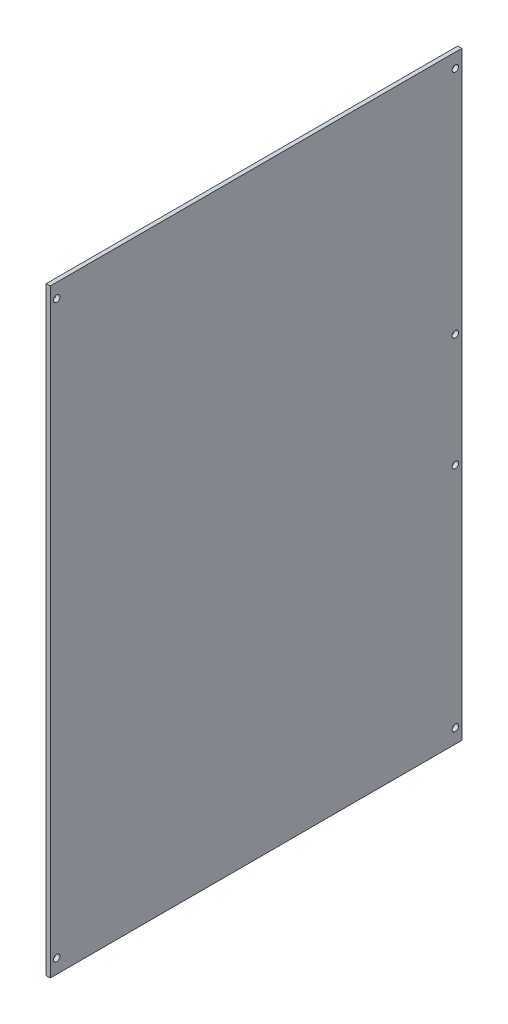
ISO-10303-21;
HEADER;
FILE_DESCRIPTION(('STEP AP214'),'2;1');
FILE_NAME('part.step','',(''),(''),'','','');
FILE_SCHEMA(('AUTOMOTIVE_DESIGN { 1 0 10303 214 1 1 1 1 }'));
ENDSEC;
DATA;
#1=APPLICATION_CONTEXT('core data for automotive mechanical design processes');
#2=APPLICATION_PROTOCOL_DEFINITION('international standard','automotive_design',2000,#1);
#3=PRODUCT_CONTEXT('',#1,'mechanical');
#4=PRODUCT('Part','Part','',(#3));
#5=PRODUCT_RELATED_PRODUCT_CATEGORY('part','',(#4));
#6=PRODUCT_DEFINITION_FORMATION('','',#4);
#7=PRODUCT_DEFINITION_CONTEXT('part definition',#1,'design');
#8=PRODUCT_DEFINITION('design','',#6,#7);
#9=PRODUCT_DEFINITION_SHAPE('','',#8);
#10=(LENGTH_UNIT() NAMED_UNIT(*) SI_UNIT(.MILLI.,.METRE.));
#11=(NAMED_UNIT(*) PLANE_ANGLE_UNIT() SI_UNIT($,.RADIAN.));
#12=(NAMED_UNIT(*) SI_UNIT($,.STERADIAN.) SOLID_ANGLE_UNIT());
#13=UNCERTAINTY_MEASURE_WITH_UNIT(LENGTH_MEASURE(1.E-05),#10,'distance_accuracy_value','');
#14=(GEOMETRIC_REPRESENTATION_CONTEXT(3) GLOBAL_UNCERTAINTY_ASSIGNED_CONTEXT((#13)) GLOBAL_UNIT_ASSIGNED_CONTEXT((#10,
#11,#12)) REPRESENTATION_CONTEXT('',''));
#15=CARTESIAN_POINT('',(0.,0.,0.));
#16=DIRECTION('',(0.,0.,1.));
#17=DIRECTION('',(1.,0.,0.));
#18=AXIS2_PLACEMENT_3D('',#15,#16,#17);
#19=CARTESIAN_POINT('',(1.5875,0.,0.));
#20=DIRECTION('',(-1.,0.,0.));
#21=DIRECTION('',(0.,0.,1.));
#22=AXIS2_PLACEMENT_3D('',#19,#20,#21);
#23=PLANE('',#22);
#24=CARTESIAN_POINT('',(1.5875,5.50000000000001,-2.50000000000233));
#25=DIRECTION('',(1.,0.,0.));
#26=DIRECTION('',(0.,0.,-1.));
#27=AXIS2_PLACEMENT_3D('',#24,#25,#26);
#28=CIRCLE('',#27,1.25);
#29=CARTESIAN_POINT('',(1.5875,5.50000000000001,-3.75000000000233));
#30=VERTEX_POINT('',#29);
#31=EDGE_CURVE('E133',#30,#30,#28,.T.);
#32=ORIENTED_EDGE('',*,*,#31,.F.);
#33=EDGE_LOOP('',(#32));
#34=FACE_BOUND('',#33,.T.);
#35=CARTESIAN_POINT('',(1.5875,227.5,-157.5));
#36=DIRECTION('',(1.,0.,0.));
#37=DIRECTION('',(0.,0.,-1.));
#38=AXIS2_PLACEMENT_3D('',#35,#36,#37);
#39=CIRCLE('',#38,1.25000000000001);
#40=CARTESIAN_POINT('',(1.5875,227.5,-158.75));
#41=VERTEX_POINT('',#40);
#42=EDGE_CURVE('E121',#41,#41,#39,.T.);
#43=ORIENTED_EDGE('',*,*,#42,.F.);
#44=EDGE_LOOP('',(#43));
#45=FACE_BOUND('',#44,.T.);
#46=CARTESIAN_POINT('',(1.5875,227.5,-2.5));
#47=DIRECTION('',(1.,0.,0.));
#48=DIRECTION('',(0.,0.,-1.));
#49=AXIS2_PLACEMENT_3D('',#46,#47,#48);
#50=CIRCLE('',#49,1.25);
#51=CARTESIAN_POINT('',(1.5875,227.5,-3.75));
#52=VERTEX_POINT('',#51);
#53=EDGE_CURVE('E100',#52,#52,#50,.T.);
#54=ORIENTED_EDGE('',*,*,#53,.F.);
#55=EDGE_LOOP('',(#54));
#56=FACE_BOUND('',#55,.T.);
#57=DIRECTION('',(0.,-1.,0.));
#58=VECTOR('',#57,1.);
#59=CARTESIAN_POINT('',(1.5875,0.,0.));
#60=LINE('',#59,#58);
#61=CARTESIAN_POINT('',(1.5875,233.,0.));
#62=VERTEX_POINT('',#61);
#63=CARTESIAN_POINT('',(1.5875,0.,0.));
#64=VERTEX_POINT('',#63);
#65=EDGE_CURVE('E85',#62,#64,#60,.T.);
#66=ORIENTED_EDGE('',*,*,#65,.T.);
#67=DIRECTION('',(0.,0.,-1.));
#68=VECTOR('',#67,1.);
#69=CARTESIAN_POINT('',(1.5875,0.,0.));
#70=LINE('',#69,#68);
#71=CARTESIAN_POINT('',(1.5875,0.,-160.));
#72=VERTEX_POINT('',#71);
#73=EDGE_CURVE('E80',#64,#72,#70,.T.);
#74=ORIENTED_EDGE('',*,*,#73,.T.);
#75=DIRECTION('',(0.,1.,0.));
#76=VECTOR('',#75,1.);
#77=CARTESIAN_POINT('',(1.5875,0.,-160.));
#78=LINE('',#77,#76);
#79=CARTESIAN_POINT('',(1.5875,233.,-160.));
#80=VERTEX_POINT('',#79);
#81=EDGE_CURVE('E83',#72,#80,#78,.T.);
#82=ORIENTED_EDGE('',*,*,#81,.T.);
#83=DIRECTION('',(0.,0.,1.));
#84=VECTOR('',#83,1.);
#85=CARTESIAN_POINT('',(1.5875,233.,0.));
#86=LINE('',#85,#84);
#87=EDGE_CURVE('E50',#80,#62,#86,.T.);
#88=ORIENTED_EDGE('',*,*,#87,.T.);
#89=EDGE_LOOP('',(#66,#74,#82,#88));
#90=FACE_BOUND('',#89,.T.);
#91=CARTESIAN_POINT('',(1.5875,94.,-157.5));
#92=DIRECTION('',(1.,0.,0.));
#93=DIRECTION('',(0.,0.,-1.));
#94=AXIS2_PLACEMENT_3D('',#91,#92,#93);
#95=CIRCLE('',#94,1.25000000000001);
#96=CARTESIAN_POINT('',(1.5875,94.,-158.75));
#97=VERTEX_POINT('',#96);
#98=EDGE_CURVE('E115',#97,#97,#95,.T.);
#99=ORIENTED_EDGE('',*,*,#98,.F.);
#100=EDGE_LOOP('',(#99));
#101=FACE_BOUND('',#100,.T.);
#102=CARTESIAN_POINT('',(1.5875,5.50000000000001,-157.500000000002));
#103=DIRECTION('',(1.,0.,0.));
#104=DIRECTION('',(0.,0.,-1.));
#105=AXIS2_PLACEMENT_3D('',#102,#103,#104);
#106=CIRCLE('',#105,1.25000000000001);
#107=CARTESIAN_POINT('',(1.5875,5.50000000000001,-158.750000000002));
#108=VERTEX_POINT('',#107);
#109=EDGE_CURVE('E127',#108,#108,#106,.T.);
#110=ORIENTED_EDGE('',*,*,#109,.F.);
#111=EDGE_LOOP('',(#110));
#112=FACE_BOUND('',#111,.T.);
#113=CARTESIAN_POINT('',(1.5875,138.,-157.5));
#114=DIRECTION('',(1.,0.,0.));
#115=DIRECTION('',(0.,0.,-1.));
#116=AXIS2_PLACEMENT_3D('',#113,#114,#115);
#117=CIRCLE('',#116,1.25000000000001);
#118=CARTESIAN_POINT('',(1.5875,138.,-158.75));
#119=VERTEX_POINT('',#118);
#120=EDGE_CURVE('E139',#119,#119,#117,.T.);
#121=ORIENTED_EDGE('',*,*,#120,.F.);
#122=EDGE_LOOP('',(#121));
#123=FACE_BOUND('',#122,.T.);
#124=ADVANCED_FACE('F33',(#34,#45,#56,#90,#101,#112,#123),#23,.F.);
#125=CARTESIAN_POINT('',(0.,0.,0.));
#126=DIRECTION('',(-1.,0.,0.));
#127=DIRECTION('',(0.,0.,1.));
#128=AXIS2_PLACEMENT_3D('',#125,#126,#127);
#129=PLANE('',#128);
#130=CARTESIAN_POINT('',(0.,5.50000000000001,-2.50000000000233));
#131=DIRECTION('',(1.,0.,0.));
#132=DIRECTION('',(0.,0.,-1.));
#133=AXIS2_PLACEMENT_3D('',#130,#131,#132);
#134=CIRCLE('',#133,1.25);
#135=CARTESIAN_POINT('',(0.,5.50000000000001,-3.75000000000233));
#136=VERTEX_POINT('',#135);
#137=EDGE_CURVE('E136',#136,#136,#134,.T.);
#138=ORIENTED_EDGE('',*,*,#137,.T.);
#139=EDGE_LOOP('',(#138));
#140=FACE_BOUND('',#139,.T.);
#141=CARTESIAN_POINT('',(0.,227.5,-157.5));
#142=DIRECTION('',(1.,0.,0.));
#143=DIRECTION('',(0.,0.,-1.));
#144=AXIS2_PLACEMENT_3D('',#141,#142,#143);
#145=CIRCLE('',#144,1.25000000000001);
#146=CARTESIAN_POINT('',(0.,227.5,-158.75));
#147=VERTEX_POINT('',#146);
#148=EDGE_CURVE('E124',#147,#147,#145,.T.);
#149=ORIENTED_EDGE('',*,*,#148,.T.);
#150=EDGE_LOOP('',(#149));
#151=FACE_BOUND('',#150,.T.);
#152=CARTESIAN_POINT('',(0.,227.5,-2.5));
#153=DIRECTION('',(1.,0.,0.));
#154=DIRECTION('',(0.,0.,-1.));
#155=AXIS2_PLACEMENT_3D('',#152,#153,#154);
#156=CIRCLE('',#155,1.25);
#157=CARTESIAN_POINT('',(0.,227.5,-3.75));
#158=VERTEX_POINT('',#157);
#159=EDGE_CURVE('E112',#158,#158,#156,.T.);
#160=ORIENTED_EDGE('',*,*,#159,.T.);
#161=EDGE_LOOP('',(#160));
#162=FACE_BOUND('',#161,.T.);
#163=DIRECTION('',(0.,-1.,0.));
#164=VECTOR('',#163,1.);
#165=CARTESIAN_POINT('',(0.,0.,0.));
#166=LINE('',#165,#164);
#167=CARTESIAN_POINT('',(0.,233.,0.));
#168=VERTEX_POINT('',#167);
#169=CARTESIAN_POINT('',(0.,0.,0.));
#170=VERTEX_POINT('',#169);
#171=EDGE_CURVE('E97',#168,#170,#166,.T.);
#172=ORIENTED_EDGE('',*,*,#171,.F.);
#173=DIRECTION('',(0.,0.,1.));
#174=VECTOR('',#173,1.);
#175=CARTESIAN_POINT('',(0.,233.,0.));
#176=LINE('',#175,#174);
#177=CARTESIAN_POINT('',(0.,233.,-160.));
#178=VERTEX_POINT('',#177);
#179=EDGE_CURVE('E73',#178,#168,#176,.T.);
#180=ORIENTED_EDGE('',*,*,#179,.F.);
#181=DIRECTION('',(0.,1.,0.));
#182=VECTOR('',#181,1.);
#183=CARTESIAN_POINT('',(0.,0.,-160.));
#184=LINE('',#183,#182);
#185=CARTESIAN_POINT('',(0.,0.,-160.));
#186=VERTEX_POINT('',#185);
#187=EDGE_CURVE('E67',#186,#178,#184,.T.);
#188=ORIENTED_EDGE('',*,*,#187,.F.);
#189=DIRECTION('',(0.,0.,-1.));
#190=VECTOR('',#189,1.);
#191=CARTESIAN_POINT('',(0.,0.,0.));
#192=LINE('',#191,#190);
#193=EDGE_CURVE('E89',#170,#186,#192,.T.);
#194=ORIENTED_EDGE('',*,*,#193,.F.);
#195=EDGE_LOOP('',(#172,#180,#188,#194));
#196=FACE_BOUND('',#195,.T.);
#197=CARTESIAN_POINT('',(0.,94.,-157.5));
#198=DIRECTION('',(1.,0.,0.));
#199=DIRECTION('',(0.,0.,-1.));
#200=AXIS2_PLACEMENT_3D('',#197,#198,#199);
#201=CIRCLE('',#200,1.25000000000001);
#202=CARTESIAN_POINT('',(0.,94.,-158.75));
#203=VERTEX_POINT('',#202);
#204=EDGE_CURVE('E118',#203,#203,#201,.T.);
#205=ORIENTED_EDGE('',*,*,#204,.T.);
#206=EDGE_LOOP('',(#205));
#207=FACE_BOUND('',#206,.T.);
#208=CARTESIAN_POINT('',(0.,5.50000000000001,-157.500000000002));
#209=DIRECTION('',(1.,0.,0.));
#210=DIRECTION('',(0.,0.,-1.));
#211=AXIS2_PLACEMENT_3D('',#208,#209,#210);
#212=CIRCLE('',#211,1.25000000000001);
#213=CARTESIAN_POINT('',(0.,5.50000000000001,-158.750000000002));
#214=VERTEX_POINT('',#213);
#215=EDGE_CURVE('E130',#214,#214,#212,.T.);
#216=ORIENTED_EDGE('',*,*,#215,.T.);
#217=EDGE_LOOP('',(#216));
#218=FACE_BOUND('',#217,.T.);
#219=CARTESIAN_POINT('',(0.,138.,-157.5));
#220=DIRECTION('',(1.,0.,0.));
#221=DIRECTION('',(0.,0.,-1.));
#222=AXIS2_PLACEMENT_3D('',#219,#220,#221);
#223=CIRCLE('',#222,1.25000000000001);
#224=CARTESIAN_POINT('',(0.,138.,-158.75));
#225=VERTEX_POINT('',#224);
#226=EDGE_CURVE('E142',#225,#225,#223,.T.);
#227=ORIENTED_EDGE('',*,*,#226,.T.);
#228=EDGE_LOOP('',(#227));
#229=FACE_BOUND('',#228,.T.);
#230=ADVANCED_FACE('F108',(#140,#151,#162,#196,#207,#218,#229),#129,.T.);
#231=CARTESIAN_POINT('',(1.5875,0.,0.));
#232=DIRECTION('',(0.,0.,-1.));
#233=DIRECTION('',(-1.,0.,0.));
#234=AXIS2_PLACEMENT_3D('',#231,#232,#233);
#235=PLANE('',#234);
#236=ORIENTED_EDGE('',*,*,#171,.T.);
#237=DIRECTION('',(-1.,0.,0.));
#238=VECTOR('',#237,1.);
#239=CARTESIAN_POINT('',(1.5875,0.,0.));
#240=LINE('',#239,#238);
#241=EDGE_CURVE('E11',#64,#170,#240,.T.);
#242=ORIENTED_EDGE('',*,*,#241,.F.);
#243=ORIENTED_EDGE('',*,*,#65,.F.);
#244=DIRECTION('',(-1.,0.,0.));
#245=VECTOR('',#244,1.);
#246=CARTESIAN_POINT('',(1.5875,233.,0.));
#247=LINE('',#246,#245);
#248=EDGE_CURVE('E93',#62,#168,#247,.T.);
#249=ORIENTED_EDGE('',*,*,#248,.T.);
#250=EDGE_LOOP('',(#236,#242,#243,#249));
#251=FACE_BOUND('',#250,.T.);
#252=ADVANCED_FACE('F35',(#251),#235,.F.);
#253=CARTESIAN_POINT('',(1.5875,0.,0.));
#254=DIRECTION('',(0.,1.,0.));
#255=DIRECTION('',(0.,0.,1.));
#256=AXIS2_PLACEMENT_3D('',#253,#254,#255);
#257=PLANE('',#256);
#258=ORIENTED_EDGE('',*,*,#193,.T.);
#259=DIRECTION('',(-1.,0.,0.));
#260=VECTOR('',#259,1.);
#261=CARTESIAN_POINT('',(1.5875,0.,-160.));
#262=LINE('',#261,#260);
#263=EDGE_CURVE('E42',#72,#186,#262,.T.);
#264=ORIENTED_EDGE('',*,*,#263,.F.);
#265=ORIENTED_EDGE('',*,*,#73,.F.);
#266=ORIENTED_EDGE('',*,*,#241,.T.);
#267=EDGE_LOOP('',(#258,#264,#265,#266));
#268=FACE_BOUND('',#267,.T.);
#269=ADVANCED_FACE('F88',(#268),#257,.F.);
#270=CARTESIAN_POINT('',(1.5875,0.,-160.));
#271=DIRECTION('',(0.,0.,1.));
#272=DIRECTION('',(1.,0.,0.));
#273=AXIS2_PLACEMENT_3D('',#270,#271,#272);
#274=PLANE('',#273);
#275=ORIENTED_EDGE('',*,*,#187,.T.);
#276=DIRECTION('',(-1.,0.,0.));
#277=VECTOR('',#276,1.);
#278=CARTESIAN_POINT('',(1.5875,233.,-160.));
#279=LINE('',#278,#277);
#280=EDGE_CURVE('E90',#80,#178,#279,.T.);
#281=ORIENTED_EDGE('',*,*,#280,.F.);
#282=ORIENTED_EDGE('',*,*,#81,.F.);
#283=ORIENTED_EDGE('',*,*,#263,.T.);
#284=EDGE_LOOP('',(#275,#281,#282,#283));
#285=FACE_BOUND('',#284,.T.);
#286=ADVANCED_FACE('F91',(#285),#274,.F.);
#287=CARTESIAN_POINT('',(1.5875,233.,0.));
#288=DIRECTION('',(0.,-1.,0.));
#289=DIRECTION('',(0.,0.,-1.));
#290=AXIS2_PLACEMENT_3D('',#287,#288,#289);
#291=PLANE('',#290);
#292=ORIENTED_EDGE('',*,*,#179,.T.);
#293=ORIENTED_EDGE('',*,*,#248,.F.);
#294=ORIENTED_EDGE('',*,*,#87,.F.);
#295=ORIENTED_EDGE('',*,*,#280,.T.);
#296=EDGE_LOOP('',(#292,#293,#294,#295));
#297=FACE_BOUND('',#296,.T.);
#298=ADVANCED_FACE('F105',(#297),#291,.F.);
#299=CARTESIAN_POINT('',(1.5875,227.5,-2.5));
#300=DIRECTION('',(-1.,0.,0.));
#301=DIRECTION('',(0.,0.,1.));
#302=AXIS2_PLACEMENT_3D('',#299,#300,#301);
#303=CYLINDRICAL_SURFACE('',#302,1.25);
#304=ORIENTED_EDGE('',*,*,#53,.T.);
#305=EDGE_LOOP('',(#304));
#306=FACE_BOUND('',#305,.T.);
#307=ORIENTED_EDGE('',*,*,#159,.F.);
#308=EDGE_LOOP('',(#307));
#309=FACE_BOUND('',#308,.T.);
#310=ADVANCED_FACE('F162',(#306,#309),#303,.F.);
#311=CARTESIAN_POINT('',(1.5875,94.,-157.5));
#312=DIRECTION('',(-1.,0.,0.));
#313=DIRECTION('',(0.,0.,1.));
#314=AXIS2_PLACEMENT_3D('',#311,#312,#313);
#315=CYLINDRICAL_SURFACE('',#314,1.25000000000001);
#316=ORIENTED_EDGE('',*,*,#98,.T.);
#317=EDGE_LOOP('',(#316));
#318=FACE_BOUND('',#317,.T.);
#319=ORIENTED_EDGE('',*,*,#204,.F.);
#320=EDGE_LOOP('',(#319));
#321=FACE_BOUND('',#320,.T.);
#322=ADVANCED_FACE('F208',(#318,#321),#315,.F.);
#323=CARTESIAN_POINT('',(1.5875,227.5,-157.5));
#324=DIRECTION('',(-1.,0.,0.));
#325=DIRECTION('',(0.,0.,1.));
#326=AXIS2_PLACEMENT_3D('',#323,#324,#325);
#327=CYLINDRICAL_SURFACE('',#326,1.25000000000001);
#328=ORIENTED_EDGE('',*,*,#42,.T.);
#329=EDGE_LOOP('',(#328));
#330=FACE_BOUND('',#329,.T.);
#331=ORIENTED_EDGE('',*,*,#148,.F.);
#332=EDGE_LOOP('',(#331));
#333=FACE_BOUND('',#332,.T.);
#334=ADVANCED_FACE('F216',(#330,#333),#327,.F.);
#335=CARTESIAN_POINT('',(1.5875,5.50000000000001,-157.500000000002));
#336=DIRECTION('',(-1.,0.,0.));
#337=DIRECTION('',(0.,0.,1.));
#338=AXIS2_PLACEMENT_3D('',#335,#336,#337);
#339=CYLINDRICAL_SURFACE('',#338,1.25000000000001);
#340=ORIENTED_EDGE('',*,*,#109,.T.);
#341=EDGE_LOOP('',(#340));
#342=FACE_BOUND('',#341,.T.);
#343=ORIENTED_EDGE('',*,*,#215,.F.);
#344=EDGE_LOOP('',(#343));
#345=FACE_BOUND('',#344,.T.);
#346=ADVANCED_FACE('F224',(#342,#345),#339,.F.);
#347=CARTESIAN_POINT('',(1.5875,5.50000000000001,-2.50000000000233));
#348=DIRECTION('',(-1.,0.,0.));
#349=DIRECTION('',(0.,0.,1.));
#350=AXIS2_PLACEMENT_3D('',#347,#348,#349);
#351=CYLINDRICAL_SURFACE('',#350,1.25);
#352=ORIENTED_EDGE('',*,*,#31,.T.);
#353=EDGE_LOOP('',(#352));
#354=FACE_BOUND('',#353,.T.);
#355=ORIENTED_EDGE('',*,*,#137,.F.);
#356=EDGE_LOOP('',(#355));
#357=FACE_BOUND('',#356,.T.);
#358=ADVANCED_FACE('F233',(#354,#357),#351,.F.);
#359=CARTESIAN_POINT('',(1.5875,138.,-157.5));
#360=DIRECTION('',(-1.,0.,0.));
#361=DIRECTION('',(0.,0.,1.));
#362=AXIS2_PLACEMENT_3D('',#359,#360,#361);
#363=CYLINDRICAL_SURFACE('',#362,1.25000000000001);
#364=ORIENTED_EDGE('',*,*,#120,.T.);
#365=EDGE_LOOP('',(#364));
#366=FACE_BOUND('',#365,.T.);
#367=ORIENTED_EDGE('',*,*,#226,.F.);
#368=EDGE_LOOP('',(#367));
#369=FACE_BOUND('',#368,.T.);
#370=ADVANCED_FACE('F148',(#366,#369),#363,.F.);
#371=CLOSED_SHELL('',(#124,#230,#252,#269,#286,#298,#310,#322,#334,#346,#358,#370));
#372=MANIFOLD_SOLID_BREP('B2',#371);
#373=ADVANCED_BREP_SHAPE_REPRESENTATION('',(#18,#372),#14);
#374=SHAPE_DEFINITION_REPRESENTATION(#9,#373);
ENDSEC;
END-ISO-10303-21;
